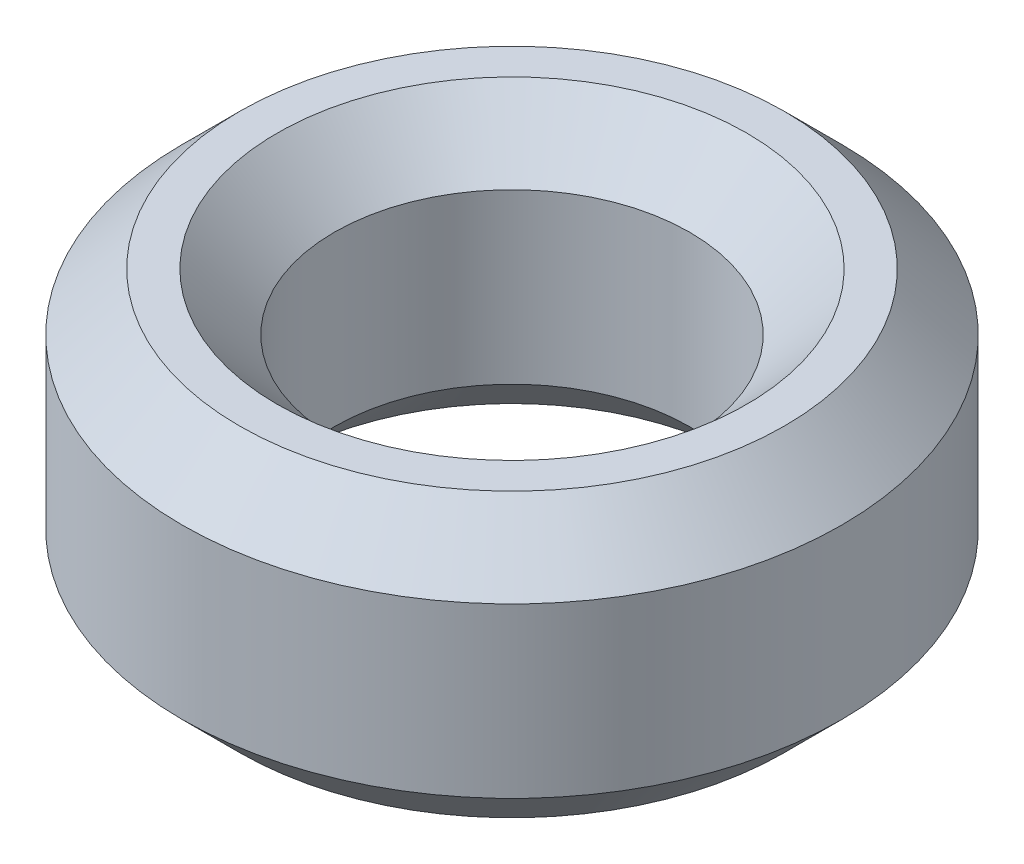
ISO-10303-21;
HEADER;
FILE_DESCRIPTION(('STEP AP214'),'2;1');
FILE_NAME('part.step','',(''),(''),'','','');
FILE_SCHEMA(('AUTOMOTIVE_DESIGN { 1 0 10303 214 1 1 1 1 }'));
ENDSEC;
DATA;
#1=APPLICATION_CONTEXT('core data for automotive mechanical design processes');
#2=APPLICATION_PROTOCOL_DEFINITION('international standard','automotive_design',2000,#1);
#3=PRODUCT_CONTEXT('',#1,'mechanical');
#4=PRODUCT('Part','Part','',(#3));
#5=PRODUCT_RELATED_PRODUCT_CATEGORY('part','',(#4));
#6=PRODUCT_DEFINITION_FORMATION('','',#4);
#7=PRODUCT_DEFINITION_CONTEXT('part definition',#1,'design');
#8=PRODUCT_DEFINITION('design','',#6,#7);
#9=PRODUCT_DEFINITION_SHAPE('','',#8);
#10=(LENGTH_UNIT() NAMED_UNIT(*) SI_UNIT(.MILLI.,.METRE.));
#11=(NAMED_UNIT(*) PLANE_ANGLE_UNIT() SI_UNIT($,.RADIAN.));
#12=(NAMED_UNIT(*) SI_UNIT($,.STERADIAN.) SOLID_ANGLE_UNIT());
#13=UNCERTAINTY_MEASURE_WITH_UNIT(LENGTH_MEASURE(1.E-05),#10,'distance_accuracy_value','');
#14=(GEOMETRIC_REPRESENTATION_CONTEXT(3) GLOBAL_UNCERTAINTY_ASSIGNED_CONTEXT((#13)) GLOBAL_UNIT_ASSIGNED_CONTEXT((#10,
#11,#12)) REPRESENTATION_CONTEXT('',''));
#15=CARTESIAN_POINT('',(0.,0.,0.));
#16=DIRECTION('',(0.,0.,1.));
#17=DIRECTION('',(1.,0.,0.));
#18=AXIS2_PLACEMENT_3D('',#15,#16,#17);
#19=CARTESIAN_POINT('',(0.,19.3025970404112,0.));
#20=DIRECTION('',(0.,-1.,0.));
#21=DIRECTION('',(0.,0.,-1.));
#22=AXIS2_PLACEMENT_3D('',#19,#20,#21);
#23=CYLINDRICAL_SURFACE('',#22,22.5);
#24=CARTESIAN_POINT('',(0.,3.90477279376339,0.));
#25=DIRECTION('',(0.,1.,0.));
#26=DIRECTION('',(0.,0.,1.));
#27=AXIS2_PLACEMENT_3D('',#24,#25,#26);
#28=CIRCLE('',#27,22.5);
#29=CARTESIAN_POINT('',(0.,3.90477279376339,-22.5));
#30=VERTEX_POINT('',#29);
#31=EDGE_CURVE('E10',#30,#30,#28,.T.);
#32=CARTESIAN_POINT('',(0.,15.3978242466478,0.));
#33=DIRECTION('',(0.,1.,0.));
#34=DIRECTION('',(0.,0.,1.));
#35=AXIS2_PLACEMENT_3D('',#32,#33,#34);
#36=CIRCLE('',#35,22.5);
#37=CARTESIAN_POINT('',(0.,15.3978242466478,-22.5));
#38=VERTEX_POINT('',#37);
#39=EDGE_CURVE('E50',#38,#38,#36,.F.);
#40=CARTESIAN_POINT('',(0.,3.90477279376339,-22.5));
#41=CARTESIAN_POINT('',(0.,4.02449207973094,-22.5));
#42=CARTESIAN_POINT('',(0.,4.14421136569848,-22.5));
#43=CARTESIAN_POINT('',(0.,4.38364993763358,-22.5));
#44=CARTESIAN_POINT('',(0.,4.50336922360112,-22.5));
#45=CARTESIAN_POINT('',(0.,4.74280779553621,-22.5));
#46=CARTESIAN_POINT('',(0.,4.86252708150376,-22.5));
#47=CARTESIAN_POINT('',(0.,5.10196565343885,-22.5));
#48=CARTESIAN_POINT('',(0.,5.2216849394064,-22.5));
#49=CARTESIAN_POINT('',(0.,5.46112351134149,-22.5));
#50=CARTESIAN_POINT('',(0.,5.58084279730903,-22.5));
#51=CARTESIAN_POINT('',(0.,5.82028136924412,-22.5));
#52=CARTESIAN_POINT('',(0.,5.94000065521167,-22.5));
#53=CARTESIAN_POINT('',(0.,6.17943922714676,-22.5));
#54=CARTESIAN_POINT('',(0.,6.29915851311431,-22.5));
#55=CARTESIAN_POINT('',(0.,6.5385970850494,-22.5));
#56=CARTESIAN_POINT('',(0.,6.65831637101694,-22.5));
#57=CARTESIAN_POINT('',(0.,6.89775494295204,-22.5));
#58=CARTESIAN_POINT('',(0.,7.01747422891958,-22.5));
#59=CARTESIAN_POINT('',(0.,7.25691280085467,-22.5));
#60=CARTESIAN_POINT('',(0.,7.37663208682222,-22.5));
#61=CARTESIAN_POINT('',(0.,7.61607065875731,-22.5));
#62=CARTESIAN_POINT('',(0.,7.73578994472486,-22.5));
#63=CARTESIAN_POINT('',(0.,7.97522851665995,-22.5));
#64=CARTESIAN_POINT('',(0.,8.09494780262749,-22.5));
#65=CARTESIAN_POINT('',(0.,8.33438637456259,-22.5));
#66=CARTESIAN_POINT('',(0.,8.45410566053013,-22.5));
#67=CARTESIAN_POINT('',(0.,8.69354423246522,-22.5));
#68=CARTESIAN_POINT('',(0.,8.81326351843277,-22.5));
#69=CARTESIAN_POINT('',(0.,9.05270209036786,-22.5));
#70=CARTESIAN_POINT('',(0.,9.17242137633541,-22.5));
#71=CARTESIAN_POINT('',(0.,9.4118599482705,-22.5));
#72=CARTESIAN_POINT('',(0.,9.53157923423804,-22.5));
#73=CARTESIAN_POINT('',(0.,9.77101780617314,-22.5));
#74=CARTESIAN_POINT('',(0.,9.89073709214068,-22.5));
#75=CARTESIAN_POINT('',(0.,10.1301756640758,-22.5));
#76=CARTESIAN_POINT('',(0.,10.2498949500433,-22.5));
#77=CARTESIAN_POINT('',(0.,10.4893335219784,-22.5));
#78=CARTESIAN_POINT('',(0.,10.609052807946,-22.5));
#79=CARTESIAN_POINT('',(0.,10.848491379881,-22.5));
#80=CARTESIAN_POINT('',(0.,10.9682106658486,-22.5));
#81=CARTESIAN_POINT('',(0.,11.2076492377837,-22.5));
#82=CARTESIAN_POINT('',(0.,11.3273685237512,-22.5));
#83=CARTESIAN_POINT('',(0.,11.5668070956863,-22.5));
#84=CARTESIAN_POINT('',(0.,11.6865263816539,-22.5));
#85=CARTESIAN_POINT('',(0.,11.925964953589,-22.5));
#86=CARTESIAN_POINT('',(0.,12.0456842395565,-22.5));
#87=CARTESIAN_POINT('',(0.,12.2851228114916,-22.5));
#88=CARTESIAN_POINT('',(0.,12.4048420974591,-22.5));
#89=CARTESIAN_POINT('',(0.,12.6442806693942,-22.5));
#90=CARTESIAN_POINT('',(0.,12.7639999553618,-22.5));
#91=CARTESIAN_POINT('',(0.,13.0034385272969,-22.5));
#92=CARTESIAN_POINT('',(0.,13.1231578132644,-22.5));
#93=CARTESIAN_POINT('',(0.,13.3625963851995,-22.5));
#94=CARTESIAN_POINT('',(0.,13.4823156711671,-22.5));
#95=CARTESIAN_POINT('',(0.,13.7217542431021,-22.5));
#96=CARTESIAN_POINT('',(0.,13.8414735290697,-22.5));
#97=CARTESIAN_POINT('',(0.,14.0809121010048,-22.5));
#98=CARTESIAN_POINT('',(0.,14.2006313869723,-22.5));
#99=CARTESIAN_POINT('',(0.,14.4400699589074,-22.5));
#100=CARTESIAN_POINT('',(0.,14.559789244875,-22.5));
#101=CARTESIAN_POINT('',(0.,14.7992278168101,-22.5));
#102=CARTESIAN_POINT('',(0.,14.9189471027776,-22.5));
#103=CARTESIAN_POINT('',(0.,15.1583856747127,-22.5));
#104=CARTESIAN_POINT('',(0.,15.2781049606802,-22.5));
#105=CARTESIAN_POINT('',(0.,15.3978242466478,-22.5));
#106=B_SPLINE_CURVE_WITH_KNOTS('',3,(#40,#41,#42,#43,#44,#45,#46,#47,#48,#49,#50,#51,#52,#53,
#54,#55,#56,#57,#58,#59,#60,#61,#62,#63,#64,#65,#66,#67,#68,#69,#70,#71,#72,#73,#74,#75,#76,#77,
#78,#79,#80,#81,#82,#83,#84,#85,#86,#87,#88,#89,#90,#91,#92,#93,#94,#95,#96,#97,#98,#99,#100,
#101,#102,#103,#104,#105),.UNSPECIFIED.,.F.,.F.,(4,2,2,2,2,2,2,2,2,2,2,2,2,2,2,2,2,2,2,2,2,2,2,
2,2,2,2,2,2,2,2,2,4),(0.,0.359157857902637,0.718315715805275,1.07747357370791,1.43663143161055,
1.79578928951319,2.15494714741582,2.51410500531846,2.8732628632211,3.23242072112374,
3.59157857902637,3.95073643692901,4.30989429483165,4.66905215273429,5.02821001063692,
5.38736786853956,5.7465257264422,6.10568358434483,6.46484144224747,6.82399930015011,
7.18315715805275,7.54231501595538,7.90147287385802,8.26063073176066,8.6197885896633,
8.97894644756593,9.33810430546857,9.69726216337121,10.0564200212738,10.4155778791765,
10.7747357370791,11.1338935949818,11.4930514528844),.UNSPECIFIED.);
#107=EDGE_CURVE('BSEAM39',#30,#38,#106,.T.);
#108=ORIENTED_EDGE('',*,*,#31,.T.);
#109=ORIENTED_EDGE('',*,*,#39,.T.);
#110=ORIENTED_EDGE('',*,*,#107,.T.);
#111=ORIENTED_EDGE('',*,*,#107,.F.);
#112=EDGE_LOOP('',(#108,#110,#109,#111));
#113=FACE_BOUND('',#112,.T.);
#114=ADVANCED_FACE('F39',(#113),#23,.T.);
#115=CARTESIAN_POINT('',(0.,19.3025970404112,0.));
#116=DIRECTION('',(0.,1.,0.));
#117=DIRECTION('',(0.,0.,1.));
#118=AXIS2_PLACEMENT_3D('',#115,#116,#117);
#119=PLANE('',#118);
#120=CARTESIAN_POINT('',(0.,19.3025970404112,0.));
#121=DIRECTION('',(0.,1.,0.));
#122=DIRECTION('',(0.,0.,1.));
#123=AXIS2_PLACEMENT_3D('',#120,#121,#122);
#124=CIRCLE('',#123,16.0291682154975);
#125=CARTESIAN_POINT('',(0.,19.3025970404112,16.0291682154975));
#126=VERTEX_POINT('',#125);
#127=EDGE_CURVE('E58',#126,#126,#124,.F.);
#128=ORIENTED_EDGE('',*,*,#127,.T.);
#129=EDGE_LOOP('',(#128));
#130=FACE_BOUND('',#129,.T.);
#131=CARTESIAN_POINT('',(0.,19.3025970404112,0.));
#132=DIRECTION('',(0.,1.,0.));
#133=DIRECTION('',(0.,0.,1.));
#134=AXIS2_PLACEMENT_3D('',#131,#132,#133);
#135=CIRCLE('',#134,18.5952272062366);
#136=CARTESIAN_POINT('',(0.,19.3025970404112,-18.5952272062366));
#137=VERTEX_POINT('',#136);
#138=EDGE_CURVE('E61',#137,#137,#135,.T.);
#139=ORIENTED_EDGE('',*,*,#138,.T.);
#140=EDGE_LOOP('',(#139));
#141=FACE_BOUND('',#140,.T.);
#142=ADVANCED_FACE('F88',(#130,#141),#119,.T.);
#143=CARTESIAN_POINT('',(0.,0.,0.));
#144=DIRECTION('',(0.,1.,0.));
#145=DIRECTION('',(0.,0.,1.));
#146=AXIS2_PLACEMENT_3D('',#143,#144,#145);
#147=PLANE('',#146);
#148=CARTESIAN_POINT('',(0.,0.,0.));
#149=DIRECTION('',(0.,1.,0.));
#150=DIRECTION('',(0.,0.,1.));
#151=AXIS2_PLACEMENT_3D('',#148,#149,#150);
#152=CIRCLE('',#151,16.0291682154975);
#153=CARTESIAN_POINT('',(0.,0.,-16.0291682154975));
#154=VERTEX_POINT('',#153);
#155=EDGE_CURVE('E51',#154,#154,#152,.T.);
#156=ORIENTED_EDGE('',*,*,#155,.T.);
#157=EDGE_LOOP('',(#156));
#158=FACE_BOUND('',#157,.T.);
#159=CARTESIAN_POINT('',(0.,0.,0.));
#160=DIRECTION('',(0.,1.,0.));
#161=DIRECTION('',(0.,0.,1.));
#162=AXIS2_PLACEMENT_3D('',#159,#160,#161);
#163=CIRCLE('',#162,18.5952272062366);
#164=CARTESIAN_POINT('',(0.,0.,18.5952272062366));
#165=VERTEX_POINT('',#164);
#166=EDGE_CURVE('E54',#165,#165,#163,.F.);
#167=ORIENTED_EDGE('',*,*,#166,.T.);
#168=EDGE_LOOP('',(#167));
#169=FACE_BOUND('',#168,.T.);
#170=ADVANCED_FACE('F83',(#158,#169),#147,.F.);
#171=CARTESIAN_POINT('',(0.,19.3025970404112,0.));
#172=DIRECTION('',(0.,-1.,0.));
#173=DIRECTION('',(0.,0.,-1.));
#174=AXIS2_PLACEMENT_3D('',#171,#172,#173);
#175=CYLINDRICAL_SURFACE('',#174,12.1243954217341);
#176=CARTESIAN_POINT('',(0.,15.3978242466478,0.));
#177=DIRECTION('',(0.,1.,0.));
#178=DIRECTION('',(0.,0.,1.));
#179=AXIS2_PLACEMENT_3D('',#176,#177,#178);
#180=CIRCLE('',#179,12.1243954217341);
#181=CARTESIAN_POINT('',(0.,15.3978242466478,-12.1243954217341));
#182=VERTEX_POINT('',#181);
#183=EDGE_CURVE('E67',#182,#182,#180,.T.);
#184=CARTESIAN_POINT('',(0.,3.9047727937634,0.));
#185=DIRECTION('',(0.,1.,0.));
#186=DIRECTION('',(0.,0.,1.));
#187=AXIS2_PLACEMENT_3D('',#184,#185,#186);
#188=CIRCLE('',#187,12.1243954217341);
#189=CARTESIAN_POINT('',(0.,3.9047727937634,-12.1243954217341));
#190=VERTEX_POINT('',#189);
#191=EDGE_CURVE('E69',#190,#190,#188,.F.);
#192=CARTESIAN_POINT('',(0.,15.3978242466478,-12.1243954217341));
#193=CARTESIAN_POINT('',(0.,15.2781049606803,-12.1243954217341));
#194=CARTESIAN_POINT('',(0.,15.1583856747127,-12.1243954217341));
#195=CARTESIAN_POINT('',(0.,14.9189471027776,-12.1243954217341));
#196=CARTESIAN_POINT('',(0.,14.7992278168101,-12.1243954217341));
#197=CARTESIAN_POINT('',(0.,14.559789244875,-12.1243954217341));
#198=CARTESIAN_POINT('',(0.,14.4400699589074,-12.1243954217341));
#199=CARTESIAN_POINT('',(0.,14.2006313869723,-12.1243954217341));
#200=CARTESIAN_POINT('',(0.,14.0809121010048,-12.1243954217341));
#201=CARTESIAN_POINT('',(0.,13.8414735290697,-12.1243954217341));
#202=CARTESIAN_POINT('',(0.,13.7217542431022,-12.1243954217341));
#203=CARTESIAN_POINT('',(0.,13.4823156711671,-12.1243954217341));
#204=CARTESIAN_POINT('',(0.,13.3625963851995,-12.1243954217341));
#205=CARTESIAN_POINT('',(0.,13.1231578132644,-12.1243954217341));
#206=CARTESIAN_POINT('',(0.,13.0034385272969,-12.1243954217341));
#207=CARTESIAN_POINT('',(0.,12.7639999553618,-12.1243954217341));
#208=CARTESIAN_POINT('',(0.,12.6442806693942,-12.1243954217341));
#209=CARTESIAN_POINT('',(0.,12.4048420974592,-12.1243954217341));
#210=CARTESIAN_POINT('',(0.,12.2851228114916,-12.1243954217341));
#211=CARTESIAN_POINT('',(0.,12.0456842395565,-12.1243954217341));
#212=CARTESIAN_POINT('',(0.,11.925964953589,-12.1243954217341));
#213=CARTESIAN_POINT('',(0.,11.6865263816539,-12.1243954217341));
#214=CARTESIAN_POINT('',(0.,11.5668070956863,-12.1243954217341));
#215=CARTESIAN_POINT('',(0.,11.3273685237512,-12.1243954217341));
#216=CARTESIAN_POINT('',(0.,11.2076492377837,-12.1243954217341));
#217=CARTESIAN_POINT('',(0.,10.9682106658486,-12.1243954217341));
#218=CARTESIAN_POINT('',(0.,10.8484913798811,-12.1243954217341));
#219=CARTESIAN_POINT('',(0.,10.609052807946,-12.1243954217341));
#220=CARTESIAN_POINT('',(0.,10.4893335219784,-12.1243954217341));
#221=CARTESIAN_POINT('',(0.,10.2498949500433,-12.1243954217341));
#222=CARTESIAN_POINT('',(0.,10.1301756640758,-12.1243954217341));
#223=CARTESIAN_POINT('',(0.,9.89073709214069,-12.1243954217341));
#224=CARTESIAN_POINT('',(0.,9.77101780617314,-12.1243954217341));
#225=CARTESIAN_POINT('',(0.,9.53157923423805,-12.1243954217341));
#226=CARTESIAN_POINT('',(0.,9.41185994827051,-12.1243954217341));
#227=CARTESIAN_POINT('',(0.,9.17242137633542,-12.1243954217341));
#228=CARTESIAN_POINT('',(0.,9.05270209036787,-12.1243954217341));
#229=CARTESIAN_POINT('',(0.,8.81326351843278,-12.1243954217341));
#230=CARTESIAN_POINT('',(0.,8.69354423246523,-12.1243954217341));
#231=CARTESIAN_POINT('',(0.,8.45410566053014,-12.1243954217341));
#232=CARTESIAN_POINT('',(0.,8.33438637456259,-12.1243954217341));
#233=CARTESIAN_POINT('',(0.,8.0949478026275,-12.1243954217341));
#234=CARTESIAN_POINT('',(0.,7.97522851665996,-12.1243954217341));
#235=CARTESIAN_POINT('',(0.,7.73578994472487,-12.1243954217341));
#236=CARTESIAN_POINT('',(0.,7.61607065875732,-12.1243954217341));
#237=CARTESIAN_POINT('',(0.,7.37663208682223,-12.1243954217341));
#238=CARTESIAN_POINT('',(0.,7.25691280085468,-12.1243954217341));
#239=CARTESIAN_POINT('',(0.,7.01747422891959,-12.1243954217341));
#240=CARTESIAN_POINT('',(0.,6.89775494295205,-12.1243954217341));
#241=CARTESIAN_POINT('',(0.,6.65831637101695,-12.1243954217341));
#242=CARTESIAN_POINT('',(0.,6.53859708504941,-12.1243954217341));
#243=CARTESIAN_POINT('',(0.,6.29915851311432,-12.1243954217341));
#244=CARTESIAN_POINT('',(0.,6.17943922714677,-12.1243954217341));
#245=CARTESIAN_POINT('',(0.,5.94000065521168,-12.1243954217341));
#246=CARTESIAN_POINT('',(0.,5.82028136924413,-12.1243954217341));
#247=CARTESIAN_POINT('',(0.,5.58084279730904,-12.1243954217341));
#248=CARTESIAN_POINT('',(0.,5.4611235113415,-12.1243954217341));
#249=CARTESIAN_POINT('',(0.,5.2216849394064,-12.1243954217341));
#250=CARTESIAN_POINT('',(0.,5.10196565343886,-12.1243954217341));
#251=CARTESIAN_POINT('',(0.,4.86252708150377,-12.1243954217341));
#252=CARTESIAN_POINT('',(0.,4.74280779553622,-12.1243954217341));
#253=CARTESIAN_POINT('',(0.,4.50336922360113,-12.1243954217341));
#254=CARTESIAN_POINT('',(0.,4.38364993763358,-12.1243954217341));
#255=CARTESIAN_POINT('',(0.,4.14421136569849,-12.1243954217341));
#256=CARTESIAN_POINT('',(0.,4.02449207973094,-12.1243954217341));
#257=CARTESIAN_POINT('',(0.,3.9047727937634,-12.1243954217341));
#258=B_SPLINE_CURVE_WITH_KNOTS('',3,(#192,#193,#194,#195,#196,#197,#198,#199,#200,#201,#202,
#203,#204,#205,#206,#207,#208,#209,#210,#211,#212,#213,#214,#215,#216,#217,#218,#219,#220,#221,
#222,#223,#224,#225,#226,#227,#228,#229,#230,#231,#232,#233,#234,#235,#236,#237,#238,#239,#240,
#241,#242,#243,#244,#245,#246,#247,#248,#249,#250,#251,#252,#253,#254,#255,#256,#257),
.UNSPECIFIED.,.F.,.F.,(4,2,2,2,2,2,2,2,2,2,2,2,2,2,2,2,2,2,2,2,2,2,2,2,2,2,2,2,2,2,2,2,4),(0.,
0.359157857902637,0.718315715805273,1.07747357370791,1.43663143161055,1.79578928951319,
2.15494714741582,2.51410500531846,2.8732628632211,3.23242072112374,3.59157857902637,
3.95073643692901,4.30989429483165,4.66905215273429,5.02821001063692,5.38736786853956,
5.7465257264422,6.10568358434484,6.46484144224747,6.82399930015011,7.18315715805275,
7.54231501595539,7.90147287385802,8.26063073176066,8.6197885896633,8.97894644756594,
9.33810430546857,9.69726216337121,10.0564200212739,10.4155778791765,10.7747357370791,
11.1338935949818,11.4930514528844),.UNSPECIFIED.);
#259=EDGE_CURVE('BSEAM71',#182,#190,#258,.T.);
#260=ORIENTED_EDGE('',*,*,#183,.T.);
#261=ORIENTED_EDGE('',*,*,#191,.T.);
#262=ORIENTED_EDGE('',*,*,#259,.T.);
#263=ORIENTED_EDGE('',*,*,#259,.F.);
#264=EDGE_LOOP('',(#260,#262,#261,#263));
#265=FACE_BOUND('',#264,.T.);
#266=ADVANCED_FACE('F71',(#265),#175,.F.);
#267=CARTESIAN_POINT('',(0.,15.3978242466478,0.));
#268=DIRECTION('',(0.,1.,0.));
#269=DIRECTION('',(0.,0.,1.));
#270=AXIS2_PLACEMENT_3D('',#267,#268,#269);
#271=CONICAL_SURFACE('',#270,12.1243954217341,0.785398163397452);
#272=ORIENTED_EDGE('',*,*,#127,.F.);
#273=EDGE_LOOP('',(#272));
#274=FACE_BOUND('',#273,.T.);
#275=ORIENTED_EDGE('',*,*,#183,.F.);
#276=EDGE_LOOP('',(#275));
#277=FACE_BOUND('',#276,.T.);
#278=ADVANCED_FACE('F77',(#274,#277),#271,.F.);
#279=CARTESIAN_POINT('',(0.,0.,0.));
#280=DIRECTION('',(0.,-1.,0.));
#281=DIRECTION('',(0.,0.,-1.));
#282=AXIS2_PLACEMENT_3D('',#279,#280,#281);
#283=CONICAL_SURFACE('',#282,16.0291682154975,0.785398163397445);
#284=CARTESIAN_POINT('',(0.,3.9047727937634,-12.1243954217341));
#285=CARTESIAN_POINT('',(0.,3.8640980771617,-12.1650701383358));
#286=CARTESIAN_POINT('',(0.,3.82342336055999,-12.2057448549375));
#287=CARTESIAN_POINT('',(0.,3.74207392735659,-12.2870942881409));
#288=CARTESIAN_POINT('',(0.,3.70139921075489,-12.3277690047426));
#289=CARTESIAN_POINT('',(0.,3.62004977755148,-12.409118437946));
#290=CARTESIAN_POINT('',(0.,3.57937506094978,-12.4497931545477));
#291=CARTESIAN_POINT('',(0.,3.49802562774638,-12.5311425877511));
#292=CARTESIAN_POINT('',(0.,3.45735091114468,-12.5718173043528));
#293=CARTESIAN_POINT('',(0.,3.37600147794127,-12.6531667375562));
#294=CARTESIAN_POINT('',(0.,3.33532676133957,-12.6938414541579));
#295=CARTESIAN_POINT('',(0.,3.25397732813617,-12.7751908873613));
#296=CARTESIAN_POINT('',(0.,3.21330261153446,-12.815865603963));
#297=CARTESIAN_POINT('',(0.,3.13195317833106,-12.8972150371664));
#298=CARTESIAN_POINT('',(0.,3.09127846172936,-12.9378897537681));
#299=CARTESIAN_POINT('',(0.,3.00992902852595,-13.0192391869715));
#300=CARTESIAN_POINT('',(0.,2.96925431192425,-13.0599139035732));
#301=CARTESIAN_POINT('',(0.,2.88790487872085,-13.1412633367766));
#302=CARTESIAN_POINT('',(0.,2.84723016211914,-13.1819380533783));
#303=CARTESIAN_POINT('',(0.,2.76588072891574,-13.2632874865817));
#304=CARTESIAN_POINT('',(0.,2.72520601231404,-13.3039622031834));
#305=CARTESIAN_POINT('',(0.,2.64385657911063,-13.3853116363868));
#306=CARTESIAN_POINT('',(0.,2.60318186250893,-13.4259863529885));
#307=CARTESIAN_POINT('',(0.,2.52183242930553,-13.507335786192));
#308=CARTESIAN_POINT('',(0.,2.48115771270383,-13.5480105027937));
#309=CARTESIAN_POINT('',(0.,2.39980827950042,-13.6293599359971));
#310=CARTESIAN_POINT('',(0.,2.35913356289872,-13.6700346525988));
#311=CARTESIAN_POINT('',(0.,2.27778412969532,-13.7513840858022));
#312=CARTESIAN_POINT('',(0.,2.23710941309361,-13.7920588024039));
#313=CARTESIAN_POINT('',(0.,2.15575997989021,-13.8734082356073));
#314=CARTESIAN_POINT('',(0.,2.11508526328851,-13.914082952209));
#315=CARTESIAN_POINT('',(0.,2.0337358300851,-13.9954323854124));
#316=CARTESIAN_POINT('',(0.,1.9930611134834,-14.0361071020141));
#317=CARTESIAN_POINT('',(0.,1.91171168028,-14.1174565352175));
#318=CARTESIAN_POINT('',(0.,1.8710369636783,-14.1581312518192));
#319=CARTESIAN_POINT('',(0.,1.78968753047489,-14.2394806850226));
#320=CARTESIAN_POINT('',(0.,1.74901281387319,-14.2801554016243));
#321=CARTESIAN_POINT('',(0.,1.66766338066978,-14.3615048348277));
#322=CARTESIAN_POINT('',(0.,1.62698866406808,-14.4021795514294));
#323=CARTESIAN_POINT('',(0.,1.54563923086468,-14.4835289846328));
#324=CARTESIAN_POINT('',(0.,1.50496451426298,-14.5242037012345));
#325=CARTESIAN_POINT('',(0.,1.42361508105957,-14.6055531344379));
#326=CARTESIAN_POINT('',(0.,1.38294036445787,-14.6462278510396));
#327=CARTESIAN_POINT('',(0.,1.30159093125447,-14.727577284243));
#328=CARTESIAN_POINT('',(0.,1.26091621465276,-14.7682520008447));
#329=CARTESIAN_POINT('',(0.,1.17956678144936,-14.8496014340481));
#330=CARTESIAN_POINT('',(0.,1.13889206484766,-14.8902761506498));
#331=CARTESIAN_POINT('',(0.,1.05754263164425,-14.9716255838532));
#332=CARTESIAN_POINT('',(0.,1.01686791504255,-15.0123003004549));
#333=CARTESIAN_POINT('',(0.,0.935518481839148,-15.0936497336583));
#334=CARTESIAN_POINT('',(0.,0.894843765237446,-15.13432445026));
#335=CARTESIAN_POINT('',(0.,0.813494332034041,-15.2156738834634));
#336=CARTESIAN_POINT('',(0.,0.772819615432339,-15.2563486000651));
#337=CARTESIAN_POINT('',(0.,0.691470182228935,-15.3376980332685));
#338=CARTESIAN_POINT('',(0.,0.650795465627233,-15.3783727498702));
#339=CARTESIAN_POINT('',(0.,0.569446032423829,-15.4597221830736));
#340=CARTESIAN_POINT('',(0.,0.528771315822127,-15.5003968996753));
#341=CARTESIAN_POINT('',(0.,0.447421882618723,-15.5817463328787));
#342=CARTESIAN_POINT('',(0.,0.406747166017021,-15.6224210494804));
#343=CARTESIAN_POINT('',(0.,0.325397732813617,-15.7037704826839));
#344=CARTESIAN_POINT('',(0.,0.284723016211914,-15.7444451992855));
#345=CARTESIAN_POINT('',(0.,0.20337358300851,-15.825794632489));
#346=CARTESIAN_POINT('',(0.,0.162698866406808,-15.8664693490907));
#347=CARTESIAN_POINT('',(0.,0.0813494332034048,-15.9478187822941));
#348=CARTESIAN_POINT('',(0.,0.040674716601703,-15.9884934988958));
#349=CARTESIAN_POINT('',(0.,0.,-16.0291682154975));
#350=B_SPLINE_CURVE_WITH_KNOTS('',3,(#284,#285,#286,#287,#288,#289,#290,#291,#292,#293,#294,
#295,#296,#297,#298,#299,#300,#301,#302,#303,#304,#305,#306,#307,#308,#309,#310,#311,#312,#313,
#314,#315,#316,#317,#318,#319,#320,#321,#322,#323,#324,#325,#326,#327,#328,#329,#330,#331,#332,
#333,#334,#335,#336,#337,#338,#339,#340,#341,#342,#343,#344,#345,#346,#347,#348,#349),
.UNSPECIFIED.,.F.,.F.,(4,2,2,2,2,2,2,2,2,2,2,2,2,2,2,2,2,2,2,2,2,2,2,2,2,2,2,2,2,2,2,2,4),(0.,
0.172568207591427,0.345136415182855,0.517704622774281,0.690272830365708,0.862841037957135,
1.03540924554856,1.20797745313999,1.38054566073142,1.55311386832284,1.72568207591427,
1.8982502835057,2.07081849109712,2.24338669868855,2.41595490627998,2.5885231138714,
2.76109132146283,2.93365952905426,3.10622773664569,3.27879594423711,3.45136415182854,
3.62393235941997,3.79650056701139,3.96906877460282,4.14163698219425,4.31420518978567,
4.4867733973771,4.65934160496853,4.83190981255995,5.00447802015138,5.17704622774281,
5.34961443533424,5.52218264292566),.UNSPECIFIED.);
#351=EDGE_CURVE('BSEAM73',#190,#154,#350,.T.);
#352=ORIENTED_EDGE('',*,*,#191,.F.);
#353=ORIENTED_EDGE('',*,*,#155,.F.);
#354=ORIENTED_EDGE('',*,*,#351,.T.);
#355=ORIENTED_EDGE('',*,*,#351,.F.);
#356=EDGE_LOOP('',(#352,#354,#353,#355));
#357=FACE_BOUND('',#356,.T.);
#358=ADVANCED_FACE('F73',(#357),#283,.F.);
#359=CARTESIAN_POINT('',(0.,3.90477279376339,0.));
#360=DIRECTION('',(0.,1.,0.));
#361=DIRECTION('',(0.,0.,1.));
#362=AXIS2_PLACEMENT_3D('',#359,#360,#361);
#363=CONICAL_SURFACE('',#362,22.5,0.785398163397452);
#364=ORIENTED_EDGE('',*,*,#166,.F.);
#365=EDGE_LOOP('',(#364));
#366=FACE_BOUND('',#365,.T.);
#367=ORIENTED_EDGE('',*,*,#31,.F.);
#368=EDGE_LOOP('',(#367));
#369=FACE_BOUND('',#368,.T.);
#370=ADVANCED_FACE('F76',(#366,#369),#363,.T.);
#371=CARTESIAN_POINT('',(0.,19.3025970404112,0.));
#372=DIRECTION('',(0.,-1.,0.));
#373=DIRECTION('',(0.,0.,-1.));
#374=AXIS2_PLACEMENT_3D('',#371,#372,#373);
#375=CONICAL_SURFACE('',#374,18.5952272062366,0.785398163397445);
#376=CARTESIAN_POINT('',(0.,15.3978242466478,-22.5));
#377=CARTESIAN_POINT('',(0.,15.4384989632495,-22.4593252833983));
#378=CARTESIAN_POINT('',(0.,15.4791736798512,-22.4186505667966));
#379=CARTESIAN_POINT('',(0.,15.5605231130546,-22.3373011335932));
#380=CARTESIAN_POINT('',(0.,15.6011978296563,-22.2966264169915));
#381=CARTESIAN_POINT('',(0.,15.6825472628597,-22.2152769837881));
#382=CARTESIAN_POINT('',(0.,15.7232219794614,-22.1746022671864));
#383=CARTESIAN_POINT('',(0.,15.8045714126648,-22.093252833983));
#384=CARTESIAN_POINT('',(0.,15.8452461292665,-22.0525781173813));
#385=CARTESIAN_POINT('',(0.,15.9265955624699,-21.9712286841779));
#386=CARTESIAN_POINT('',(0.,15.9672702790716,-21.9305539675762));
#387=CARTESIAN_POINT('',(0.,16.048619712275,-21.8492045343728));
#388=CARTESIAN_POINT('',(0.,16.0892944288767,-21.8085298177711));
#389=CARTESIAN_POINT('',(0.,16.1706438620801,-21.7271803845677));
#390=CARTESIAN_POINT('',(0.,16.2113185786818,-21.686505667966));
#391=CARTESIAN_POINT('',(0.,16.2926680118852,-21.6051562347626));
#392=CARTESIAN_POINT('',(0.,16.3333427284869,-21.5644815181609));
#393=CARTESIAN_POINT('',(0.,16.4146921616903,-21.4831320849575));
#394=CARTESIAN_POINT('',(0.,16.455366878292,-21.4424573683558));
#395=CARTESIAN_POINT('',(0.,16.5367163114954,-21.3611079351524));
#396=CARTESIAN_POINT('',(0.,16.5773910280971,-21.3204332185507));
#397=CARTESIAN_POINT('',(0.,16.6587404613006,-21.2390837853472));
#398=CARTESIAN_POINT('',(0.,16.6994151779022,-21.1984090687455));
#399=CARTESIAN_POINT('',(0.,16.7807646111057,-21.1170596355421));
#400=CARTESIAN_POINT('',(0.,16.8214393277074,-21.0763849189404));
#401=CARTESIAN_POINT('',(0.,16.9027887609108,-20.995035485737));
#402=CARTESIAN_POINT('',(0.,16.9434634775125,-20.9543607691353));
#403=CARTESIAN_POINT('',(0.,17.0248129107159,-20.8730113359319));
#404=CARTESIAN_POINT('',(0.,17.0654876273176,-20.8323366193302));
#405=CARTESIAN_POINT('',(0.,17.146837060521,-20.7509871861268));
#406=CARTESIAN_POINT('',(0.,17.1875117771227,-20.7103124695251));
#407=CARTESIAN_POINT('',(0.,17.2688612103261,-20.6289630363217));
#408=CARTESIAN_POINT('',(0.,17.3095359269278,-20.58828831972));
#409=CARTESIAN_POINT('',(0.,17.3908853601312,-20.5069388865166));
#410=CARTESIAN_POINT('',(0.,17.4315600767329,-20.4662641699149));
#411=CARTESIAN_POINT('',(0.,17.5129095099363,-20.3849147367115));
#412=CARTESIAN_POINT('',(0.,17.553584226538,-20.3442400201098));
#413=CARTESIAN_POINT('',(0.,17.6349336597414,-20.2628905869064));
#414=CARTESIAN_POINT('',(0.,17.6756083763431,-20.2222158703047));
#415=CARTESIAN_POINT('',(0.,17.7569578095465,-20.1408664371013));
#416=CARTESIAN_POINT('',(0.,17.7976325261482,-20.1001917204996));
#417=CARTESIAN_POINT('',(0.,17.8789819593516,-20.0188422872962));
#418=CARTESIAN_POINT('',(0.,17.9196566759533,-19.9781675706945));
#419=CARTESIAN_POINT('',(0.,18.0010061091567,-19.8968181374911));
#420=CARTESIAN_POINT('',(0.,18.0416808257584,-19.8561434208894));
#421=CARTESIAN_POINT('',(0.,18.1230302589618,-19.774793987686));
#422=CARTESIAN_POINT('',(0.,18.1637049755635,-19.7341192710843));
#423=CARTESIAN_POINT('',(0.,18.2450544087669,-19.6527698378809));
#424=CARTESIAN_POINT('',(0.,18.2857291253686,-19.6120951212792));
#425=CARTESIAN_POINT('',(0.,18.367078558572,-19.5307456880758));
#426=CARTESIAN_POINT('',(0.,18.4077532751737,-19.4900709714741));
#427=CARTESIAN_POINT('',(0.,18.4891027083771,-19.4087215382707));
#428=CARTESIAN_POINT('',(0.,18.5297774249788,-19.368046821669));
#429=CARTESIAN_POINT('',(0.,18.6111268581822,-19.2866973884656));
#430=CARTESIAN_POINT('',(0.,18.651801574784,-19.2460226718639));
#431=CARTESIAN_POINT('',(0.,18.7331510079874,-19.1646732386605));
#432=CARTESIAN_POINT('',(0.,18.7738257245891,-19.1239985220588));
#433=CARTESIAN_POINT('',(0.,18.8551751577925,-19.0426490888554));
#434=CARTESIAN_POINT('',(0.,18.8958498743942,-19.0019743722537));
#435=CARTESIAN_POINT('',(0.,18.9771993075976,-18.9206249390502));
#436=CARTESIAN_POINT('',(0.,19.0178740241993,-18.8799502224485));
#437=CARTESIAN_POINT('',(0.,19.0992234574027,-18.7986007892451));
#438=CARTESIAN_POINT('',(0.,19.1398981740044,-18.7579260726434));
#439=CARTESIAN_POINT('',(0.,19.2212476072078,-18.67657663944));
#440=CARTESIAN_POINT('',(0.,19.2619223238095,-18.6359019228383));
#441=CARTESIAN_POINT('',(0.,19.3025970404112,-18.5952272062366));
#442=B_SPLINE_CURVE_WITH_KNOTS('',3,(#376,#377,#378,#379,#380,#381,#382,#383,#384,#385,#386,
#387,#388,#389,#390,#391,#392,#393,#394,#395,#396,#397,#398,#399,#400,#401,#402,#403,#404,#405,
#406,#407,#408,#409,#410,#411,#412,#413,#414,#415,#416,#417,#418,#419,#420,#421,#422,#423,#424,
#425,#426,#427,#428,#429,#430,#431,#432,#433,#434,#435,#436,#437,#438,#439,#440,#441),
.UNSPECIFIED.,.F.,.F.,(4,2,2,2,2,2,2,2,2,2,2,2,2,2,2,2,2,2,2,2,2,2,2,2,2,2,2,2,2,2,2,2,4),(0.,
0.172568207591428,0.345136415182855,0.517704622774282,0.690272830365709,0.862841037957136,
1.03540924554856,1.20797745313999,1.38054566073142,1.55311386832284,1.72568207591427,
1.8982502835057,2.07081849109713,2.24338669868855,2.41595490627998,2.58852311387141,
2.76109132146283,2.93365952905426,3.10622773664569,3.27879594423711,3.45136415182854,
3.62393235941997,3.79650056701139,3.96906877460282,4.14163698219425,4.31420518978567,
4.4867733973771,4.65934160496853,4.83190981255996,5.00447802015138,5.17704622774281,
5.34961443533424,5.52218264292567),.UNSPECIFIED.);
#443=EDGE_CURVE('BSEAM45',#38,#137,#442,.T.);
#444=ORIENTED_EDGE('',*,*,#39,.F.);
#445=ORIENTED_EDGE('',*,*,#138,.F.);
#446=ORIENTED_EDGE('',*,*,#443,.T.);
#447=ORIENTED_EDGE('',*,*,#443,.F.);
#448=EDGE_LOOP('',(#444,#446,#445,#447));
#449=FACE_BOUND('',#448,.T.);
#450=ADVANCED_FACE('F45',(#449),#375,.T.);
#451=CLOSED_SHELL('',(#114,#142,#170,#266,#278,#358,#370,#450));
#452=MANIFOLD_SOLID_BREP('B2',#451);
#453=ADVANCED_BREP_SHAPE_REPRESENTATION('',(#18,#452),#14);
#454=SHAPE_DEFINITION_REPRESENTATION(#9,#453);
ENDSEC;
END-ISO-10303-21;
